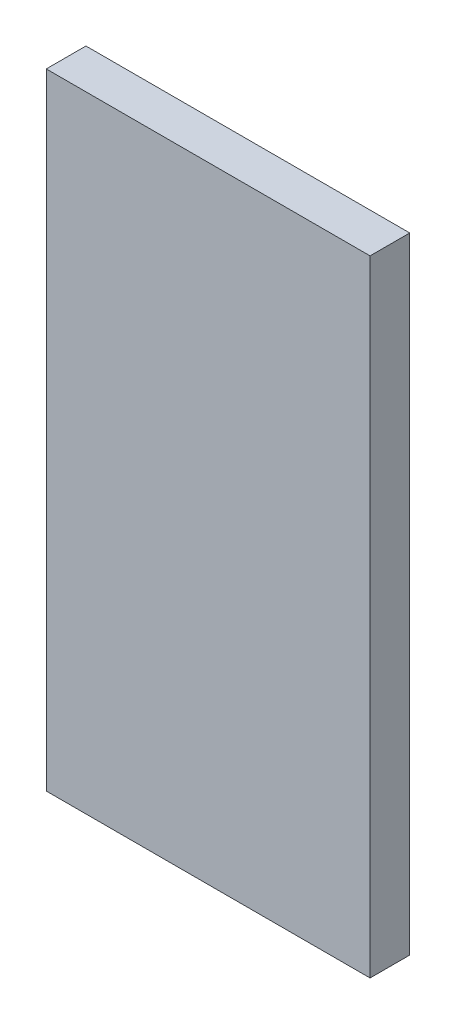
ISO-10303-21;
HEADER;
FILE_DESCRIPTION(('STEP AP214'),'2;1');
FILE_NAME('part.step','',(''),(''),'','','');
FILE_SCHEMA(('AUTOMOTIVE_DESIGN { 1 0 10303 214 1 1 1 1 }'));
ENDSEC;
DATA;
#1=APPLICATION_CONTEXT('core data for automotive mechanical design processes');
#2=APPLICATION_PROTOCOL_DEFINITION('international standard','automotive_design',2000,#1);
#3=PRODUCT_CONTEXT('',#1,'mechanical');
#4=PRODUCT('Part','Part','',(#3));
#5=PRODUCT_RELATED_PRODUCT_CATEGORY('part','',(#4));
#6=PRODUCT_DEFINITION_FORMATION('','',#4);
#7=PRODUCT_DEFINITION_CONTEXT('part definition',#1,'design');
#8=PRODUCT_DEFINITION('design','',#6,#7);
#9=PRODUCT_DEFINITION_SHAPE('','',#8);
#10=(LENGTH_UNIT() NAMED_UNIT(*) SI_UNIT(.MILLI.,.METRE.));
#11=(NAMED_UNIT(*) PLANE_ANGLE_UNIT() SI_UNIT($,.RADIAN.));
#12=(NAMED_UNIT(*) SI_UNIT($,.STERADIAN.) SOLID_ANGLE_UNIT());
#13=UNCERTAINTY_MEASURE_WITH_UNIT(LENGTH_MEASURE(1.E-05),#10,'distance_accuracy_value','');
#14=(GEOMETRIC_REPRESENTATION_CONTEXT(3) GLOBAL_UNCERTAINTY_ASSIGNED_CONTEXT((#13)) GLOBAL_UNIT_ASSIGNED_CONTEXT((#10,
#11,#12)) REPRESENTATION_CONTEXT('',''));
#15=CARTESIAN_POINT('',(0.,0.,0.));
#16=DIRECTION('',(0.,0.,1.));
#17=DIRECTION('',(1.,0.,0.));
#18=AXIS2_PLACEMENT_3D('',#15,#16,#17);
#19=CARTESIAN_POINT('',(2.132,-3.698,0.1));
#20=DIRECTION('',(0.,0.,1.));
#21=DIRECTION('',(1.,0.,0.));
#22=AXIS2_PLACEMENT_3D('',#19,#20,#21);
#23=PLANE('',#22);
#24=DIRECTION('',(0.,1.,0.));
#25=VECTOR('',#24,1.);
#26=CARTESIAN_POINT('',(2.948,-3.698,0.1));
#27=LINE('',#26,#25);
#28=CARTESIAN_POINT('',(2.948,-2.122,0.1));
#29=VERTEX_POINT('',#28);
#30=CARTESIAN_POINT('',(2.948,-3.698,0.1));
#31=VERTEX_POINT('',#30);
#32=EDGE_CURVE('E75',#29,#31,#27,.F.);
#33=ORIENTED_EDGE('',*,*,#32,.F.);
#34=DIRECTION('',(1.,0.,0.));
#35=VECTOR('',#34,1.);
#36=CARTESIAN_POINT('',(2.132,-2.122,0.1));
#37=LINE('',#36,#35);
#38=CARTESIAN_POINT('',(2.132,-2.122,0.1));
#39=VERTEX_POINT('',#38);
#40=EDGE_CURVE('E57',#39,#29,#37,.T.);
#41=ORIENTED_EDGE('',*,*,#40,.F.);
#42=DIRECTION('',(0.,1.,0.));
#43=VECTOR('',#42,1.);
#44=CARTESIAN_POINT('',(2.132,-3.698,0.1));
#45=LINE('',#44,#43);
#46=CARTESIAN_POINT('',(2.132,-3.698,0.1));
#47=VERTEX_POINT('',#46);
#48=EDGE_CURVE('E19',#39,#47,#45,.F.);
#49=ORIENTED_EDGE('',*,*,#48,.T.);
#50=DIRECTION('',(1.,0.,0.));
#51=VECTOR('',#50,1.);
#52=CARTESIAN_POINT('',(2.132,-3.698,0.1));
#53=LINE('',#52,#51);
#54=EDGE_CURVE('E54',#47,#31,#53,.T.);
#55=ORIENTED_EDGE('',*,*,#54,.T.);
#56=EDGE_LOOP('',(#33,#41,#49,#55));
#57=FACE_BOUND('',#56,.T.);
#58=ADVANCED_FACE('F16',(#57),#23,.T.);
#59=CARTESIAN_POINT('',(2.132,-3.698,0.));
#60=DIRECTION('',(1.,0.,0.));
#61=DIRECTION('',(0.,0.,-1.));
#62=AXIS2_PLACEMENT_3D('',#59,#60,#61);
#63=PLANE('',#62);
#64=DIRECTION('',(0.,0.,1.));
#65=VECTOR('',#64,1.);
#66=CARTESIAN_POINT('',(2.132,-2.122,0.));
#67=LINE('',#66,#65);
#68=CARTESIAN_POINT('',(2.132,-2.122,0.));
#69=VERTEX_POINT('',#68);
#70=EDGE_CURVE('E77',#69,#39,#67,.T.);
#71=ORIENTED_EDGE('',*,*,#70,.F.);
#72=DIRECTION('',(0.,1.,0.));
#73=VECTOR('',#72,1.);
#74=CARTESIAN_POINT('',(2.132,-3.698,0.));
#75=LINE('',#74,#73);
#76=CARTESIAN_POINT('',(2.132,-3.698,0.));
#77=VERTEX_POINT('',#76);
#78=EDGE_CURVE('E72',#69,#77,#75,.F.);
#79=ORIENTED_EDGE('',*,*,#78,.T.);
#80=DIRECTION('',(0.,0.,1.));
#81=VECTOR('',#80,1.);
#82=CARTESIAN_POINT('',(2.132,-3.698,0.));
#83=LINE('',#82,#81);
#84=EDGE_CURVE('E62',#77,#47,#83,.T.);
#85=ORIENTED_EDGE('',*,*,#84,.T.);
#86=ORIENTED_EDGE('',*,*,#48,.F.);
#87=EDGE_LOOP('',(#71,#79,#85,#86));
#88=FACE_BOUND('',#87,.T.);
#89=ADVANCED_FACE('F71',(#88),#63,.F.);
#90=CARTESIAN_POINT('',(2.132,-3.698,0.));
#91=DIRECTION('',(0.,1.,0.));
#92=DIRECTION('',(0.,0.,1.));
#93=AXIS2_PLACEMENT_3D('',#90,#91,#92);
#94=PLANE('',#93);
#95=ORIENTED_EDGE('',*,*,#54,.F.);
#96=ORIENTED_EDGE('',*,*,#84,.F.);
#97=DIRECTION('',(1.,0.,0.));
#98=VECTOR('',#97,1.);
#99=CARTESIAN_POINT('',(2.132,-3.698,0.));
#100=LINE('',#99,#98);
#101=CARTESIAN_POINT('',(2.948,-3.698,0.));
#102=VERTEX_POINT('',#101);
#103=EDGE_CURVE('E82',#77,#102,#100,.T.);
#104=ORIENTED_EDGE('',*,*,#103,.T.);
#105=DIRECTION('',(0.,0.,-1.));
#106=VECTOR('',#105,1.);
#107=CARTESIAN_POINT('',(2.948,-3.698,0.));
#108=LINE('',#107,#106);
#109=EDGE_CURVE('E68',#31,#102,#108,.T.);
#110=ORIENTED_EDGE('',*,*,#109,.F.);
#111=EDGE_LOOP('',(#95,#96,#104,#110));
#112=FACE_BOUND('',#111,.T.);
#113=ADVANCED_FACE('F65',(#112),#94,.F.);
#114=CARTESIAN_POINT('',(2.948,-3.698,0.));
#115=DIRECTION('',(1.,0.,0.));
#116=DIRECTION('',(0.,0.,-1.));
#117=AXIS2_PLACEMENT_3D('',#114,#115,#116);
#118=PLANE('',#117);
#119=DIRECTION('',(0.,0.,1.));
#120=VECTOR('',#119,1.);
#121=CARTESIAN_POINT('',(2.948,-2.122,0.));
#122=LINE('',#121,#120);
#123=CARTESIAN_POINT('',(2.948,-2.122,0.));
#124=VERTEX_POINT('',#123);
#125=EDGE_CURVE('E33',#29,#124,#122,.F.);
#126=ORIENTED_EDGE('',*,*,#125,.F.);
#127=ORIENTED_EDGE('',*,*,#32,.T.);
#128=ORIENTED_EDGE('',*,*,#109,.T.);
#129=DIRECTION('',(0.,1.,0.));
#130=VECTOR('',#129,1.);
#131=CARTESIAN_POINT('',(2.948,-3.698,0.));
#132=LINE('',#131,#130);
#133=EDGE_CURVE('E25',#102,#124,#132,.T.);
#134=ORIENTED_EDGE('',*,*,#133,.T.);
#135=EDGE_LOOP('',(#126,#127,#128,#134));
#136=FACE_BOUND('',#135,.T.);
#137=ADVANCED_FACE('F87',(#136),#118,.T.);
#138=CARTESIAN_POINT('',(2.132,-2.122,0.));
#139=DIRECTION('',(0.,1.,0.));
#140=DIRECTION('',(0.,0.,1.));
#141=AXIS2_PLACEMENT_3D('',#138,#139,#140);
#142=PLANE('',#141);
#143=ORIENTED_EDGE('',*,*,#40,.T.);
#144=ORIENTED_EDGE('',*,*,#125,.T.);
#145=DIRECTION('',(1.,0.,0.));
#146=VECTOR('',#145,1.);
#147=CARTESIAN_POINT('',(2.132,-2.122,0.));
#148=LINE('',#147,#146);
#149=EDGE_CURVE('E11',#124,#69,#148,.F.);
#150=ORIENTED_EDGE('',*,*,#149,.T.);
#151=ORIENTED_EDGE('',*,*,#70,.T.);
#152=EDGE_LOOP('',(#143,#144,#150,#151));
#153=FACE_BOUND('',#152,.T.);
#154=ADVANCED_FACE('F90',(#153),#142,.T.);
#155=CARTESIAN_POINT('',(2.132,-3.698,0.));
#156=DIRECTION('',(0.,0.,1.));
#157=DIRECTION('',(1.,0.,0.));
#158=AXIS2_PLACEMENT_3D('',#155,#156,#157);
#159=PLANE('',#158);
#160=ORIENTED_EDGE('',*,*,#133,.F.);
#161=ORIENTED_EDGE('',*,*,#103,.F.);
#162=ORIENTED_EDGE('',*,*,#78,.F.);
#163=ORIENTED_EDGE('',*,*,#149,.F.);
#164=EDGE_LOOP('',(#160,#161,#162,#163));
#165=FACE_BOUND('',#164,.T.);
#166=ADVANCED_FACE('F89',(#165),#159,.F.);
#167=CLOSED_SHELL('',(#58,#89,#113,#137,#154,#166));
#168=MANIFOLD_SOLID_BREP('B1',#167);
#169=ADVANCED_BREP_SHAPE_REPRESENTATION('',(#18,#168),#14);
#170=SHAPE_DEFINITION_REPRESENTATION(#9,#169);
ENDSEC;
END-ISO-10303-21;
